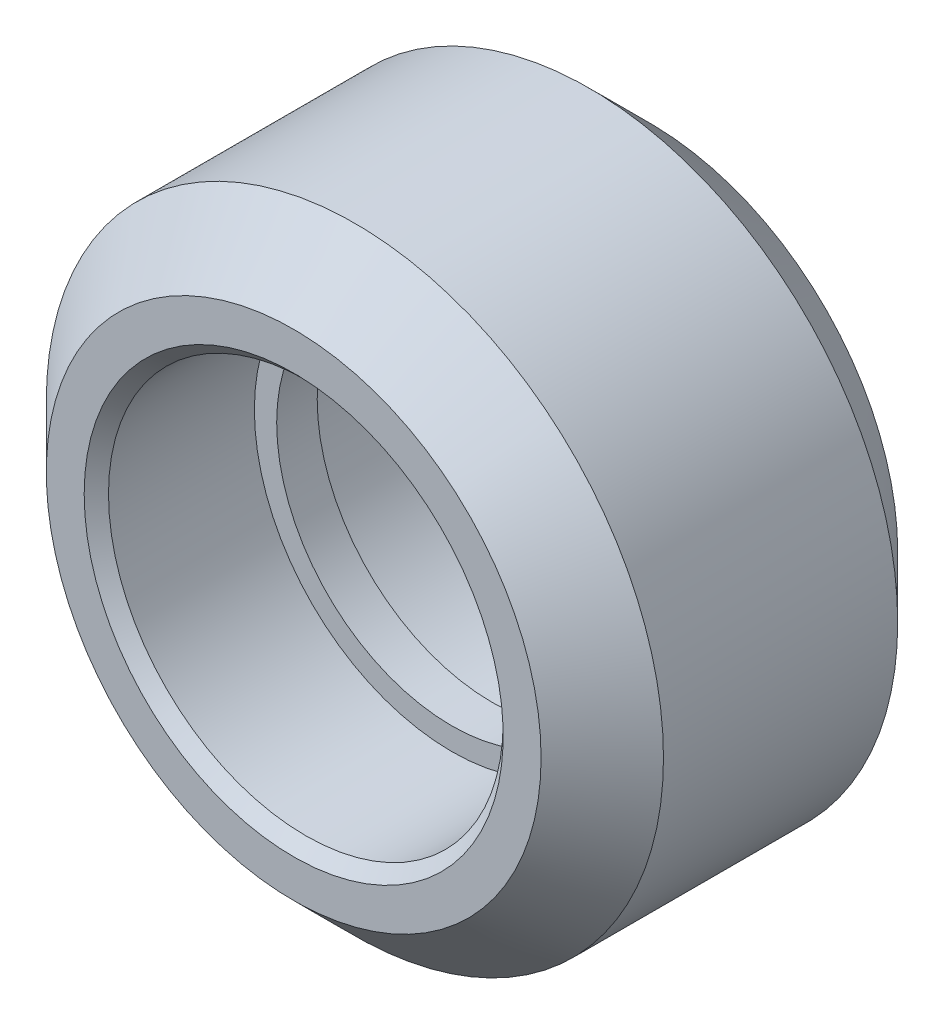
ISO-10303-21;
HEADER;
FILE_DESCRIPTION(('STEP AP214'),'2;1');
FILE_NAME('part.step','',(''),(''),'','','');
FILE_SCHEMA(('AUTOMOTIVE_DESIGN { 1 0 10303 214 1 1 1 1 }'));
ENDSEC;
DATA;
#1=APPLICATION_CONTEXT('core data for automotive mechanical design processes');
#2=APPLICATION_PROTOCOL_DEFINITION('international standard','automotive_design',2000,#1);
#3=PRODUCT_CONTEXT('',#1,'mechanical');
#4=PRODUCT('Part','Part','',(#3));
#5=PRODUCT_RELATED_PRODUCT_CATEGORY('part','',(#4));
#6=PRODUCT_DEFINITION_FORMATION('','',#4);
#7=PRODUCT_DEFINITION_CONTEXT('part definition',#1,'design');
#8=PRODUCT_DEFINITION('design','',#6,#7);
#9=PRODUCT_DEFINITION_SHAPE('','',#8);
#10=(LENGTH_UNIT() NAMED_UNIT(*) SI_UNIT(.MILLI.,.METRE.));
#11=(NAMED_UNIT(*) PLANE_ANGLE_UNIT() SI_UNIT($,.RADIAN.));
#12=(NAMED_UNIT(*) SI_UNIT($,.STERADIAN.) SOLID_ANGLE_UNIT());
#13=UNCERTAINTY_MEASURE_WITH_UNIT(LENGTH_MEASURE(1.E-05),#10,'distance_accuracy_value','');
#14=(GEOMETRIC_REPRESENTATION_CONTEXT(3) GLOBAL_UNCERTAINTY_ASSIGNED_CONTEXT((#13)) GLOBAL_UNIT_ASSIGNED_CONTEXT((#10,
#11,#12)) REPRESENTATION_CONTEXT('',''));
#15=CARTESIAN_POINT('',(0.,0.,0.));
#16=DIRECTION('',(0.,0.,1.));
#17=DIRECTION('',(1.,0.,0.));
#18=AXIS2_PLACEMENT_3D('',#15,#16,#17);
#19=CARTESIAN_POINT('',(0.,0.,0.));
#20=DIRECTION('',(0.,0.,1.));
#21=DIRECTION('',(1.,0.,0.));
#22=AXIS2_PLACEMENT_3D('',#19,#20,#21);
#23=CYLINDRICAL_SURFACE('',#22,7.615);
#24=CARTESIAN_POINT('',(0.,0.,2.89));
#25=DIRECTION('',(0.,0.,1.));
#26=DIRECTION('',(1.,0.,0.));
#27=AXIS2_PLACEMENT_3D('',#24,#25,#26);
#28=CIRCLE('',#27,7.615);
#29=CARTESIAN_POINT('',(7.615,0.,2.89));
#30=VERTEX_POINT('',#29);
#31=EDGE_CURVE('E51',#30,#30,#28,.T.);
#32=ORIENTED_EDGE('',*,*,#31,.F.);
#33=EDGE_LOOP('',(#32));
#34=FACE_BOUND('',#33,.T.);
#35=CARTESIAN_POINT('',(0.,0.,-2.89));
#36=DIRECTION('',(0.,0.,1.));
#37=DIRECTION('',(1.,0.,0.));
#38=AXIS2_PLACEMENT_3D('',#35,#36,#37);
#39=CIRCLE('',#38,7.615);
#40=CARTESIAN_POINT('',(7.615,0.,-2.89));
#41=VERTEX_POINT('',#40);
#42=EDGE_CURVE('E72',#41,#41,#39,.T.);
#43=ORIENTED_EDGE('',*,*,#42,.T.);
#44=EDGE_LOOP('',(#43));
#45=FACE_BOUND('',#44,.T.);
#46=ADVANCED_FACE('F31',(#34,#45),#23,.T.);
#47=CARTESIAN_POINT('',(0.,0.,2.89));
#48=DIRECTION('',(0.,0.,-1.));
#49=DIRECTION('',(-1.,0.,0.));
#50=AXIS2_PLACEMENT_3D('',#47,#48,#49);
#51=CONICAL_SURFACE('',#50,7.615,0.785398163397449);
#52=CARTESIAN_POINT('',(0.,0.,4.4));
#53=DIRECTION('',(0.,0.,1.));
#54=DIRECTION('',(1.,0.,0.));
#55=AXIS2_PLACEMENT_3D('',#52,#53,#54);
#56=CIRCLE('',#55,6.105);
#57=CARTESIAN_POINT('',(6.105,0.,4.4));
#58=VERTEX_POINT('',#57);
#59=EDGE_CURVE('E54',#58,#58,#56,.T.);
#60=ORIENTED_EDGE('',*,*,#59,.F.);
#61=EDGE_LOOP('',(#60));
#62=FACE_BOUND('',#61,.T.);
#63=ORIENTED_EDGE('',*,*,#31,.T.);
#64=EDGE_LOOP('',(#63));
#65=FACE_BOUND('',#64,.T.);
#66=ADVANCED_FACE('F96',(#62,#65),#51,.T.);
#67=CARTESIAN_POINT('',(0.,4.87,4.4));
#68=DIRECTION('',(0.,0.,-1.));
#69=DIRECTION('',(-1.,0.,0.));
#70=AXIS2_PLACEMENT_3D('',#67,#68,#69);
#71=PLANE('',#70);
#72=CARTESIAN_POINT('',(0.,0.,4.4));
#73=DIRECTION('',(0.,0.,-1.));
#74=DIRECTION('',(-1.,0.,0.));
#75=AXIS2_PLACEMENT_3D('',#72,#73,#74);
#76=CIRCLE('',#75,5.17);
#77=CARTESIAN_POINT('',(-5.17,0.,4.4));
#78=VERTEX_POINT('',#77);
#79=EDGE_CURVE('E10',#78,#78,#76,.T.);
#80=ORIENTED_EDGE('',*,*,#79,.T.);
#81=EDGE_LOOP('',(#80));
#82=FACE_BOUND('',#81,.T.);
#83=ORIENTED_EDGE('',*,*,#59,.T.);
#84=EDGE_LOOP('',(#83));
#85=FACE_BOUND('',#84,.T.);
#86=ADVANCED_FACE('F102',(#82,#85),#71,.F.);
#87=CARTESIAN_POINT('',(0.,0.,0.));
#88=DIRECTION('',(0.,0.,1.));
#89=DIRECTION('',(1.,0.,0.));
#90=AXIS2_PLACEMENT_3D('',#87,#88,#89);
#91=CYLINDRICAL_SURFACE('',#90,4.87);
#92=CARTESIAN_POINT('',(0.,0.,4.1));
#93=DIRECTION('',(0.,0.,-1.));
#94=DIRECTION('',(-1.,0.,0.));
#95=AXIS2_PLACEMENT_3D('',#92,#93,#94);
#96=CIRCLE('',#95,4.87);
#97=CARTESIAN_POINT('',(-4.87,0.,4.1));
#98=VERTEX_POINT('',#97);
#99=EDGE_CURVE('E38',#98,#98,#96,.F.);
#100=ORIENTED_EDGE('',*,*,#99,.T.);
#101=EDGE_LOOP('',(#100));
#102=FACE_BOUND('',#101,.T.);
#103=CARTESIAN_POINT('',(0.,0.,0.5));
#104=DIRECTION('',(0.,0.,1.));
#105=DIRECTION('',(1.,0.,0.));
#106=AXIS2_PLACEMENT_3D('',#103,#104,#105);
#107=CIRCLE('',#106,4.87);
#108=CARTESIAN_POINT('',(4.87,0.,0.5));
#109=VERTEX_POINT('',#108);
#110=EDGE_CURVE('E57',#109,#109,#107,.T.);
#111=ORIENTED_EDGE('',*,*,#110,.F.);
#112=EDGE_LOOP('',(#111));
#113=FACE_BOUND('',#112,.T.);
#114=ADVANCED_FACE('F133',(#102,#113),#91,.F.);
#115=CARTESIAN_POINT('',(0.,4.32,0.5));
#116=DIRECTION('',(0.,0.,-1.));
#117=DIRECTION('',(-1.,0.,0.));
#118=AXIS2_PLACEMENT_3D('',#115,#116,#117);
#119=PLANE('',#118);
#120=CARTESIAN_POINT('',(0.,0.,0.5));
#121=DIRECTION('',(0.,0.,1.));
#122=DIRECTION('',(1.,0.,0.));
#123=AXIS2_PLACEMENT_3D('',#120,#121,#122);
#124=CIRCLE('',#123,4.32);
#125=CARTESIAN_POINT('',(4.32,0.,0.5));
#126=VERTEX_POINT('',#125);
#127=EDGE_CURVE('E60',#126,#126,#124,.T.);
#128=ORIENTED_EDGE('',*,*,#127,.F.);
#129=EDGE_LOOP('',(#128));
#130=FACE_BOUND('',#129,.T.);
#131=ORIENTED_EDGE('',*,*,#110,.T.);
#132=EDGE_LOOP('',(#131));
#133=FACE_BOUND('',#132,.T.);
#134=ADVANCED_FACE('F127',(#130,#133),#119,.F.);
#135=CARTESIAN_POINT('',(0.,0.,0.));
#136=DIRECTION('',(0.,0.,1.));
#137=DIRECTION('',(1.,0.,0.));
#138=AXIS2_PLACEMENT_3D('',#135,#136,#137);
#139=CYLINDRICAL_SURFACE('',#138,4.32);
#140=CARTESIAN_POINT('',(0.,0.,-0.5));
#141=DIRECTION('',(0.,0.,1.));
#142=DIRECTION('',(1.,0.,0.));
#143=AXIS2_PLACEMENT_3D('',#140,#141,#142);
#144=CIRCLE('',#143,4.32);
#145=CARTESIAN_POINT('',(4.32,0.,-0.5));
#146=VERTEX_POINT('',#145);
#147=EDGE_CURVE('E63',#146,#146,#144,.T.);
#148=ORIENTED_EDGE('',*,*,#147,.F.);
#149=EDGE_LOOP('',(#148));
#150=FACE_BOUND('',#149,.T.);
#151=ORIENTED_EDGE('',*,*,#127,.T.);
#152=EDGE_LOOP('',(#151));
#153=FACE_BOUND('',#152,.T.);
#154=ADVANCED_FACE('F121',(#150,#153),#139,.F.);
#155=CARTESIAN_POINT('',(0.,4.32,-0.5));
#156=DIRECTION('',(0.,0.,1.));
#157=DIRECTION('',(1.,0.,0.));
#158=AXIS2_PLACEMENT_3D('',#155,#156,#157);
#159=PLANE('',#158);
#160=CARTESIAN_POINT('',(0.,0.,-0.5));
#161=DIRECTION('',(0.,0.,1.));
#162=DIRECTION('',(1.,0.,0.));
#163=AXIS2_PLACEMENT_3D('',#160,#161,#162);
#164=CIRCLE('',#163,4.87);
#165=CARTESIAN_POINT('',(4.87,0.,-0.5));
#166=VERTEX_POINT('',#165);
#167=EDGE_CURVE('E66',#166,#166,#164,.T.);
#168=ORIENTED_EDGE('',*,*,#167,.F.);
#169=EDGE_LOOP('',(#168));
#170=FACE_BOUND('',#169,.T.);
#171=ORIENTED_EDGE('',*,*,#147,.T.);
#172=EDGE_LOOP('',(#171));
#173=FACE_BOUND('',#172,.T.);
#174=ADVANCED_FACE('F92',(#170,#173),#159,.F.);
#175=CARTESIAN_POINT('',(0.,0.,0.));
#176=DIRECTION('',(0.,0.,1.));
#177=DIRECTION('',(1.,0.,0.));
#178=AXIS2_PLACEMENT_3D('',#175,#176,#177);
#179=CYLINDRICAL_SURFACE('',#178,4.87);
#180=CARTESIAN_POINT('',(0.,0.,-4.1));
#181=DIRECTION('',(0.,0.,1.));
#182=DIRECTION('',(1.,0.,0.));
#183=AXIS2_PLACEMENT_3D('',#180,#181,#182);
#184=CIRCLE('',#183,4.87);
#185=CARTESIAN_POINT('',(4.87,0.,-4.1));
#186=VERTEX_POINT('',#185);
#187=EDGE_CURVE('E42',#186,#186,#184,.F.);
#188=ORIENTED_EDGE('',*,*,#187,.T.);
#189=EDGE_LOOP('',(#188));
#190=FACE_BOUND('',#189,.T.);
#191=ORIENTED_EDGE('',*,*,#167,.T.);
#192=EDGE_LOOP('',(#191));
#193=FACE_BOUND('',#192,.T.);
#194=ADVANCED_FACE('F86',(#190,#193),#179,.F.);
#195=CARTESIAN_POINT('',(0.,4.87,-4.4));
#196=DIRECTION('',(0.,0.,1.));
#197=DIRECTION('',(1.,0.,0.));
#198=AXIS2_PLACEMENT_3D('',#195,#196,#197);
#199=PLANE('',#198);
#200=CARTESIAN_POINT('',(0.,0.,-4.4));
#201=DIRECTION('',(0.,0.,1.));
#202=DIRECTION('',(1.,0.,0.));
#203=AXIS2_PLACEMENT_3D('',#200,#201,#202);
#204=CIRCLE('',#203,5.17);
#205=CARTESIAN_POINT('',(5.17,0.,-4.4));
#206=VERTEX_POINT('',#205);
#207=EDGE_CURVE('E46',#206,#206,#204,.T.);
#208=ORIENTED_EDGE('',*,*,#207,.T.);
#209=EDGE_LOOP('',(#208));
#210=FACE_BOUND('',#209,.T.);
#211=CARTESIAN_POINT('',(0.,0.,-4.4));
#212=DIRECTION('',(0.,0.,1.));
#213=DIRECTION('',(1.,0.,0.));
#214=AXIS2_PLACEMENT_3D('',#211,#212,#213);
#215=CIRCLE('',#214,6.105);
#216=CARTESIAN_POINT('',(6.105,0.,-4.4));
#217=VERTEX_POINT('',#216);
#218=EDGE_CURVE('E69',#217,#217,#215,.T.);
#219=ORIENTED_EDGE('',*,*,#218,.F.);
#220=EDGE_LOOP('',(#219));
#221=FACE_BOUND('',#220,.T.);
#222=ADVANCED_FACE('F81',(#210,#221),#199,.F.);
#223=CARTESIAN_POINT('',(0.,0.,-4.4));
#224=DIRECTION('',(0.,0.,1.));
#225=DIRECTION('',(1.,0.,0.));
#226=AXIS2_PLACEMENT_3D('',#223,#224,#225);
#227=CONICAL_SURFACE('',#226,6.105,0.785398163397448);
#228=ORIENTED_EDGE('',*,*,#42,.F.);
#229=EDGE_LOOP('',(#228));
#230=FACE_BOUND('',#229,.T.);
#231=ORIENTED_EDGE('',*,*,#218,.T.);
#232=EDGE_LOOP('',(#231));
#233=FACE_BOUND('',#232,.T.);
#234=ADVANCED_FACE('F77',(#230,#233),#227,.T.);
#235=CARTESIAN_POINT('',(0.,0.,-4.4));
#236=DIRECTION('',(0.,0.,-1.));
#237=DIRECTION('',(-1.,0.,0.));
#238=AXIS2_PLACEMENT_3D('',#235,#236,#237);
#239=CONICAL_SURFACE('',#238,5.17,0.785398163397451);
#240=ORIENTED_EDGE('',*,*,#187,.F.);
#241=EDGE_LOOP('',(#240));
#242=FACE_BOUND('',#241,.T.);
#243=ORIENTED_EDGE('',*,*,#207,.F.);
#244=EDGE_LOOP('',(#243));
#245=FACE_BOUND('',#244,.T.);
#246=ADVANCED_FACE('F80',(#242,#245),#239,.F.);
#247=CARTESIAN_POINT('',(0.,0.,4.1));
#248=DIRECTION('',(0.,0.,1.));
#249=DIRECTION('',(1.,0.,0.));
#250=AXIS2_PLACEMENT_3D('',#247,#248,#249);
#251=CONICAL_SURFACE('',#250,4.87,0.785398163397448);
#252=ORIENTED_EDGE('',*,*,#79,.F.);
#253=EDGE_LOOP('',(#252));
#254=FACE_BOUND('',#253,.T.);
#255=ORIENTED_EDGE('',*,*,#99,.F.);
#256=EDGE_LOOP('',(#255));
#257=FACE_BOUND('',#256,.T.);
#258=ADVANCED_FACE('F33',(#254,#257),#251,.F.);
#259=CLOSED_SHELL('',(#46,#66,#86,#114,#134,#154,#174,#194,#222,#234,#246,#258));
#260=MANIFOLD_SOLID_BREP('B2',#259);
#261=ADVANCED_BREP_SHAPE_REPRESENTATION('',(#18,#260),#14);
#262=SHAPE_DEFINITION_REPRESENTATION(#9,#261);
ENDSEC;
END-ISO-10303-21;
